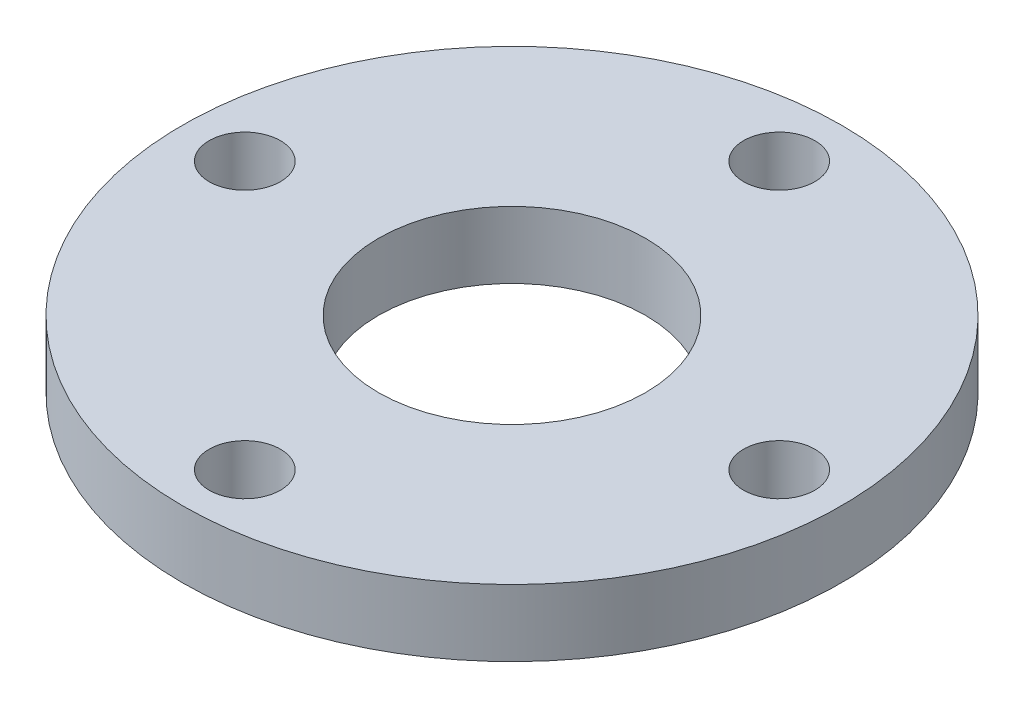
ISO-10303-21;
HEADER;
FILE_DESCRIPTION(('STEP AP214'),'2;1');
FILE_NAME('part.step','',(''),(''),'','','');
FILE_SCHEMA(('AUTOMOTIVE_DESIGN { 1 0 10303 214 1 1 1 1 }'));
ENDSEC;
DATA;
#1=APPLICATION_CONTEXT('core data for automotive mechanical design processes');
#2=APPLICATION_PROTOCOL_DEFINITION('international standard','automotive_design',2000,#1);
#3=PRODUCT_CONTEXT('',#1,'mechanical');
#4=PRODUCT('Part','Part','',(#3));
#5=PRODUCT_RELATED_PRODUCT_CATEGORY('part','',(#4));
#6=PRODUCT_DEFINITION_FORMATION('','',#4);
#7=PRODUCT_DEFINITION_CONTEXT('part definition',#1,'design');
#8=PRODUCT_DEFINITION('design','',#6,#7);
#9=PRODUCT_DEFINITION_SHAPE('','',#8);
#10=(LENGTH_UNIT() NAMED_UNIT(*) SI_UNIT(.MILLI.,.METRE.));
#11=(NAMED_UNIT(*) PLANE_ANGLE_UNIT() SI_UNIT($,.RADIAN.));
#12=(NAMED_UNIT(*) SI_UNIT($,.STERADIAN.) SOLID_ANGLE_UNIT());
#13=UNCERTAINTY_MEASURE_WITH_UNIT(LENGTH_MEASURE(1.E-05),#10,'distance_accuracy_value','');
#14=(GEOMETRIC_REPRESENTATION_CONTEXT(3) GLOBAL_UNCERTAINTY_ASSIGNED_CONTEXT((#13)) GLOBAL_UNIT_ASSIGNED_CONTEXT((#10,
#11,#12)) REPRESENTATION_CONTEXT('',''));
#15=CARTESIAN_POINT('',(0.,0.,0.));
#16=DIRECTION('',(0.,0.,1.));
#17=DIRECTION('',(1.,0.,0.));
#18=AXIS2_PLACEMENT_3D('',#15,#16,#17);
#19=CARTESIAN_POINT('',(0.,3.,0.));
#20=DIRECTION('',(0.,1.,0.));
#21=DIRECTION('',(0.,0.,1.));
#22=AXIS2_PLACEMENT_3D('',#19,#20,#21);
#23=PLANE('',#22);
#24=CARTESIAN_POINT('',(-12.,3.,0.));
#25=DIRECTION('',(0.,1.,0.));
#26=DIRECTION('',(0.,0.,1.));
#27=AXIS2_PLACEMENT_3D('',#24,#25,#26);
#28=CIRCLE('',#27,1.6);
#29=CARTESIAN_POINT('',(-12.,3.,1.59999999999992));
#30=VERTEX_POINT('',#29);
#31=EDGE_CURVE('E61',#30,#30,#28,.T.);
#32=ORIENTED_EDGE('',*,*,#31,.F.);
#33=EDGE_LOOP('',(#32));
#34=FACE_BOUND('',#33,.T.);
#35=CARTESIAN_POINT('',(12.,3.,0.));
#36=DIRECTION('',(0.,1.,0.));
#37=DIRECTION('',(0.,0.,1.));
#38=AXIS2_PLACEMENT_3D('',#35,#36,#37);
#39=CIRCLE('',#38,1.6);
#40=CARTESIAN_POINT('',(12.,3.,1.6));
#41=VERTEX_POINT('',#40);
#42=EDGE_CURVE('E49',#41,#41,#39,.T.);
#43=ORIENTED_EDGE('',*,*,#42,.F.);
#44=EDGE_LOOP('',(#43));
#45=FACE_BOUND('',#44,.T.);
#46=CARTESIAN_POINT('',(0.,3.,0.));
#47=DIRECTION('',(0.,1.,0.));
#48=DIRECTION('',(0.,0.,1.));
#49=AXIS2_PLACEMENT_3D('',#46,#47,#48);
#50=CIRCLE('',#49,14.8);
#51=CARTESIAN_POINT('',(0.,3.,14.8));
#52=VERTEX_POINT('',#51);
#53=EDGE_CURVE('E10',#52,#52,#50,.T.);
#54=ORIENTED_EDGE('',*,*,#53,.T.);
#55=EDGE_LOOP('',(#54));
#56=FACE_BOUND('',#55,.T.);
#57=CARTESIAN_POINT('',(0.,3.,0.));
#58=DIRECTION('',(0.,1.,0.));
#59=DIRECTION('',(0.,0.,1.));
#60=AXIS2_PLACEMENT_3D('',#57,#58,#59);
#61=CIRCLE('',#60,6.);
#62=CARTESIAN_POINT('',(0.,3.,6.));
#63=VERTEX_POINT('',#62);
#64=EDGE_CURVE('E44',#63,#63,#61,.T.);
#65=ORIENTED_EDGE('',*,*,#64,.F.);
#66=EDGE_LOOP('',(#65));
#67=FACE_BOUND('',#66,.T.);
#68=CARTESIAN_POINT('',(0.,3.,12.));
#69=DIRECTION('',(0.,1.,0.));
#70=DIRECTION('',(0.,0.,1.));
#71=AXIS2_PLACEMENT_3D('',#68,#69,#70);
#72=CIRCLE('',#71,1.6);
#73=CARTESIAN_POINT('',(0.,3.,13.6));
#74=VERTEX_POINT('',#73);
#75=EDGE_CURVE('E55',#74,#74,#72,.T.);
#76=ORIENTED_EDGE('',*,*,#75,.F.);
#77=EDGE_LOOP('',(#76));
#78=FACE_BOUND('',#77,.T.);
#79=CARTESIAN_POINT('',(1.25693328198353E-13,3.,-12.));
#80=DIRECTION('',(0.,1.,0.));
#81=DIRECTION('',(0.,0.,1.));
#82=AXIS2_PLACEMENT_3D('',#79,#80,#81);
#83=CIRCLE('',#82,1.6);
#84=CARTESIAN_POINT('',(1.25693328198353E-13,3.,-10.4));
#85=VERTEX_POINT('',#84);
#86=EDGE_CURVE('E67',#85,#85,#83,.T.);
#87=ORIENTED_EDGE('',*,*,#86,.F.);
#88=EDGE_LOOP('',(#87));
#89=FACE_BOUND('',#88,.T.);
#90=ADVANCED_FACE('F33',(#34,#45,#56,#67,#78,#89),#23,.T.);
#91=CARTESIAN_POINT('',(0.,0.,0.));
#92=DIRECTION('',(0.,1.,0.));
#93=DIRECTION('',(0.,0.,1.));
#94=AXIS2_PLACEMENT_3D('',#91,#92,#93);
#95=PLANE('',#94);
#96=CARTESIAN_POINT('',(0.,0.,0.));
#97=DIRECTION('',(0.,1.,0.));
#98=DIRECTION('',(0.,0.,1.));
#99=AXIS2_PLACEMENT_3D('',#96,#97,#98);
#100=CIRCLE('',#99,14.8);
#101=CARTESIAN_POINT('',(0.,0.,14.8));
#102=VERTEX_POINT('',#101);
#103=EDGE_CURVE('E37',#102,#102,#100,.T.);
#104=ORIENTED_EDGE('',*,*,#103,.F.);
#105=EDGE_LOOP('',(#104));
#106=FACE_BOUND('',#105,.T.);
#107=CARTESIAN_POINT('',(0.,0.,0.));
#108=DIRECTION('',(0.,1.,0.));
#109=DIRECTION('',(0.,0.,1.));
#110=AXIS2_PLACEMENT_3D('',#107,#108,#109);
#111=CIRCLE('',#110,6.);
#112=CARTESIAN_POINT('',(0.,0.,6.));
#113=VERTEX_POINT('',#112);
#114=EDGE_CURVE('E46',#113,#113,#111,.T.);
#115=ORIENTED_EDGE('',*,*,#114,.T.);
#116=EDGE_LOOP('',(#115));
#117=FACE_BOUND('',#116,.T.);
#118=CARTESIAN_POINT('',(12.,0.,0.));
#119=DIRECTION('',(0.,1.,0.));
#120=DIRECTION('',(0.,0.,1.));
#121=AXIS2_PLACEMENT_3D('',#118,#119,#120);
#122=CIRCLE('',#121,1.6);
#123=CARTESIAN_POINT('',(12.,0.,1.6));
#124=VERTEX_POINT('',#123);
#125=EDGE_CURVE('E52',#124,#124,#122,.T.);
#126=ORIENTED_EDGE('',*,*,#125,.T.);
#127=EDGE_LOOP('',(#126));
#128=FACE_BOUND('',#127,.T.);
#129=CARTESIAN_POINT('',(0.,0.,12.));
#130=DIRECTION('',(0.,1.,0.));
#131=DIRECTION('',(0.,0.,1.));
#132=AXIS2_PLACEMENT_3D('',#129,#130,#131);
#133=CIRCLE('',#132,1.6);
#134=CARTESIAN_POINT('',(0.,0.,13.6));
#135=VERTEX_POINT('',#134);
#136=EDGE_CURVE('E58',#135,#135,#133,.T.);
#137=ORIENTED_EDGE('',*,*,#136,.T.);
#138=EDGE_LOOP('',(#137));
#139=FACE_BOUND('',#138,.T.);
#140=CARTESIAN_POINT('',(-12.,0.,0.));
#141=DIRECTION('',(0.,1.,0.));
#142=DIRECTION('',(0.,0.,1.));
#143=AXIS2_PLACEMENT_3D('',#140,#141,#142);
#144=CIRCLE('',#143,1.6);
#145=CARTESIAN_POINT('',(-12.,0.,1.59999999999992));
#146=VERTEX_POINT('',#145);
#147=EDGE_CURVE('E64',#146,#146,#144,.T.);
#148=ORIENTED_EDGE('',*,*,#147,.T.);
#149=EDGE_LOOP('',(#148));
#150=FACE_BOUND('',#149,.T.);
#151=CARTESIAN_POINT('',(1.25693328198353E-13,0.,-12.));
#152=DIRECTION('',(0.,1.,0.));
#153=DIRECTION('',(0.,0.,1.));
#154=AXIS2_PLACEMENT_3D('',#151,#152,#153);
#155=CIRCLE('',#154,1.6);
#156=CARTESIAN_POINT('',(1.25693328198353E-13,0.,-10.4));
#157=VERTEX_POINT('',#156);
#158=EDGE_CURVE('E70',#157,#157,#155,.T.);
#159=ORIENTED_EDGE('',*,*,#158,.T.);
#160=EDGE_LOOP('',(#159));
#161=FACE_BOUND('',#160,.T.);
#162=ADVANCED_FACE('F80',(#106,#117,#128,#139,#150,#161),#95,.F.);
#163=CARTESIAN_POINT('',(0.,3.,0.));
#164=DIRECTION('',(0.,-1.,0.));
#165=DIRECTION('',(0.,0.,-1.));
#166=AXIS2_PLACEMENT_3D('',#163,#164,#165);
#167=CYLINDRICAL_SURFACE('',#166,14.8);
#168=ORIENTED_EDGE('',*,*,#53,.F.);
#169=EDGE_LOOP('',(#168));
#170=FACE_BOUND('',#169,.T.);
#171=ORIENTED_EDGE('',*,*,#103,.T.);
#172=EDGE_LOOP('',(#171));
#173=FACE_BOUND('',#172,.T.);
#174=ADVANCED_FACE('F35',(#170,#173),#167,.T.);
#175=CARTESIAN_POINT('',(0.,3.,0.));
#176=DIRECTION('',(0.,-1.,0.));
#177=DIRECTION('',(0.,0.,-1.));
#178=AXIS2_PLACEMENT_3D('',#175,#176,#177);
#179=CYLINDRICAL_SURFACE('',#178,6.);
#180=ORIENTED_EDGE('',*,*,#64,.T.);
#181=EDGE_LOOP('',(#180));
#182=FACE_BOUND('',#181,.T.);
#183=ORIENTED_EDGE('',*,*,#114,.F.);
#184=EDGE_LOOP('',(#183));
#185=FACE_BOUND('',#184,.T.);
#186=ADVANCED_FACE('F90',(#182,#185),#179,.F.);
#187=CARTESIAN_POINT('',(12.,3.,0.));
#188=DIRECTION('',(0.,-1.,0.));
#189=DIRECTION('',(0.,0.,-1.));
#190=AXIS2_PLACEMENT_3D('',#187,#188,#189);
#191=CYLINDRICAL_SURFACE('',#190,1.6);
#192=ORIENTED_EDGE('',*,*,#42,.T.);
#193=EDGE_LOOP('',(#192));
#194=FACE_BOUND('',#193,.T.);
#195=ORIENTED_EDGE('',*,*,#125,.F.);
#196=EDGE_LOOP('',(#195));
#197=FACE_BOUND('',#196,.T.);
#198=ADVANCED_FACE('F93',(#194,#197),#191,.F.);
#199=CARTESIAN_POINT('',(0.,3.,12.));
#200=DIRECTION('',(0.,-1.,0.));
#201=DIRECTION('',(0.,0.,-1.));
#202=AXIS2_PLACEMENT_3D('',#199,#200,#201);
#203=CYLINDRICAL_SURFACE('',#202,1.6);
#204=ORIENTED_EDGE('',*,*,#75,.T.);
#205=EDGE_LOOP('',(#204));
#206=FACE_BOUND('',#205,.T.);
#207=ORIENTED_EDGE('',*,*,#136,.F.);
#208=EDGE_LOOP('',(#207));
#209=FACE_BOUND('',#208,.T.);
#210=ADVANCED_FACE('F97',(#206,#209),#203,.F.);
#211=CARTESIAN_POINT('',(-12.,3.,0.));
#212=DIRECTION('',(0.,-1.,0.));
#213=DIRECTION('',(0.,0.,-1.));
#214=AXIS2_PLACEMENT_3D('',#211,#212,#213);
#215=CYLINDRICAL_SURFACE('',#214,1.6);
#216=ORIENTED_EDGE('',*,*,#31,.T.);
#217=EDGE_LOOP('',(#216));
#218=FACE_BOUND('',#217,.T.);
#219=ORIENTED_EDGE('',*,*,#147,.F.);
#220=EDGE_LOOP('',(#219));
#221=FACE_BOUND('',#220,.T.);
#222=ADVANCED_FACE('F101',(#218,#221),#215,.F.);
#223=CARTESIAN_POINT('',(1.25693328198353E-13,3.,-12.));
#224=DIRECTION('',(0.,-1.,0.));
#225=DIRECTION('',(0.,0.,-1.));
#226=AXIS2_PLACEMENT_3D('',#223,#224,#225);
#227=CYLINDRICAL_SURFACE('',#226,1.6);
#228=ORIENTED_EDGE('',*,*,#86,.T.);
#229=EDGE_LOOP('',(#228));
#230=FACE_BOUND('',#229,.T.);
#231=ORIENTED_EDGE('',*,*,#158,.F.);
#232=EDGE_LOOP('',(#231));
#233=FACE_BOUND('',#232,.T.);
#234=ADVANCED_FACE('F76',(#230,#233),#227,.F.);
#235=CLOSED_SHELL('',(#90,#162,#174,#186,#198,#210,#222,#234));
#236=MANIFOLD_SOLID_BREP('B2',#235);
#237=ADVANCED_BREP_SHAPE_REPRESENTATION('',(#18,#236),#14);
#238=SHAPE_DEFINITION_REPRESENTATION(#9,#237);
ENDSEC;
END-ISO-10303-21;
